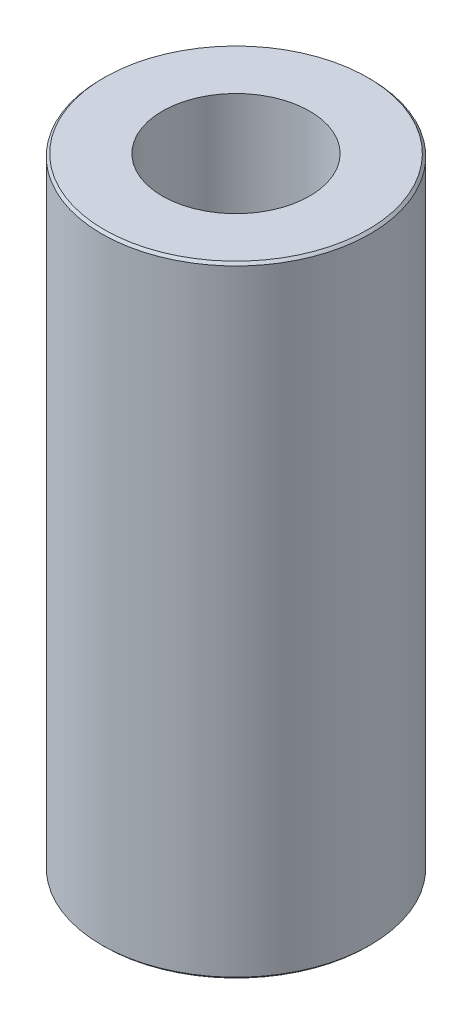
ISO-10303-21;
HEADER;
FILE_DESCRIPTION(('STEP AP214'),'2;1');
FILE_NAME('part.step','',(''),(''),'','','');
FILE_SCHEMA(('AUTOMOTIVE_DESIGN { 1 0 10303 214 1 1 1 1 }'));
ENDSEC;
DATA;
#1=APPLICATION_CONTEXT('core data for automotive mechanical design processes');
#2=APPLICATION_PROTOCOL_DEFINITION('international standard','automotive_design',2000,#1);
#3=PRODUCT_CONTEXT('',#1,'mechanical');
#4=PRODUCT('Part','Part','',(#3));
#5=PRODUCT_RELATED_PRODUCT_CATEGORY('part','',(#4));
#6=PRODUCT_DEFINITION_FORMATION('','',#4);
#7=PRODUCT_DEFINITION_CONTEXT('part definition',#1,'design');
#8=PRODUCT_DEFINITION('design','',#6,#7);
#9=PRODUCT_DEFINITION_SHAPE('','',#8);
#10=(LENGTH_UNIT() NAMED_UNIT(*) SI_UNIT(.MILLI.,.METRE.));
#11=(NAMED_UNIT(*) PLANE_ANGLE_UNIT() SI_UNIT($,.RADIAN.));
#12=(NAMED_UNIT(*) SI_UNIT($,.STERADIAN.) SOLID_ANGLE_UNIT());
#13=UNCERTAINTY_MEASURE_WITH_UNIT(LENGTH_MEASURE(1.E-05),#10,'distance_accuracy_value','');
#14=(GEOMETRIC_REPRESENTATION_CONTEXT(3) GLOBAL_UNCERTAINTY_ASSIGNED_CONTEXT((#13)) GLOBAL_UNIT_ASSIGNED_CONTEXT((#10,
#11,#12)) REPRESENTATION_CONTEXT('',''));
#15=CARTESIAN_POINT('',(0.,0.,0.));
#16=DIRECTION('',(0.,0.,1.));
#17=DIRECTION('',(1.,0.,0.));
#18=AXIS2_PLACEMENT_3D('',#15,#16,#17);
#19=CARTESIAN_POINT('',(0.,185.014265715078,0.));
#20=DIRECTION('',(0.,-1.,0.));
#21=DIRECTION('',(0.,0.,-1.));
#22=AXIS2_PLACEMENT_3D('',#19,#20,#21);
#23=CYLINDRICAL_SURFACE('',#22,40.);
#24=CARTESIAN_POINT('',(0.,184.285870189936,0.));
#25=DIRECTION('',(0.,1.,0.));
#26=DIRECTION('',(0.,0.,1.));
#27=AXIS2_PLACEMENT_3D('',#24,#25,#26);
#28=CIRCLE('',#27,40.);
#29=CARTESIAN_POINT('',(0.,184.285870189936,40.));
#30=VERTEX_POINT('',#29);
#31=EDGE_CURVE('E50',#30,#30,#28,.F.);
#32=ORIENTED_EDGE('',*,*,#31,.T.);
#33=EDGE_LOOP('',(#32));
#34=FACE_BOUND('',#33,.T.);
#35=CARTESIAN_POINT('',(0.,0.728395525141701,0.));
#36=DIRECTION('',(0.,1.,0.));
#37=DIRECTION('',(0.,0.,1.));
#38=AXIS2_PLACEMENT_3D('',#35,#36,#37);
#39=CIRCLE('',#38,40.);
#40=CARTESIAN_POINT('',(0.,0.728395525141701,40.));
#41=VERTEX_POINT('',#40);
#42=EDGE_CURVE('E51',#41,#41,#39,.T.);
#43=ORIENTED_EDGE('',*,*,#42,.T.);
#44=EDGE_LOOP('',(#43));
#45=FACE_BOUND('',#44,.T.);
#46=ADVANCED_FACE('F39',(#34,#45),#23,.T.);
#47=CARTESIAN_POINT('',(0.,185.014265715078,0.));
#48=DIRECTION('',(0.,1.,0.));
#49=DIRECTION('',(0.,0.,1.));
#50=AXIS2_PLACEMENT_3D('',#47,#48,#49);
#51=PLANE('',#50);
#52=CARTESIAN_POINT('',(0.,185.014265715078,0.));
#53=DIRECTION('',(0.,1.,0.));
#54=DIRECTION('',(0.,0.,1.));
#55=AXIS2_PLACEMENT_3D('',#52,#53,#54);
#56=CIRCLE('',#55,39.2716044748583);
#57=CARTESIAN_POINT('',(0.,185.014265715078,39.2716044748583));
#58=VERTEX_POINT('',#57);
#59=EDGE_CURVE('E54',#58,#58,#56,.T.);
#60=ORIENTED_EDGE('',*,*,#59,.T.);
#61=EDGE_LOOP('',(#60));
#62=FACE_BOUND('',#61,.T.);
#63=CARTESIAN_POINT('',(0.,185.014265715078,0.));
#64=DIRECTION('',(0.,1.,0.));
#65=DIRECTION('',(0.,0.,1.));
#66=AXIS2_PLACEMENT_3D('',#63,#64,#65);
#67=CIRCLE('',#66,21.9494563485371);
#68=CARTESIAN_POINT('',(0.,185.014265715078,21.9494563485371));
#69=VERTEX_POINT('',#68);
#70=EDGE_CURVE('E58',#69,#69,#67,.T.);
#71=ORIENTED_EDGE('',*,*,#70,.F.);
#72=EDGE_LOOP('',(#71));
#73=FACE_BOUND('',#72,.T.);
#74=ADVANCED_FACE('F69',(#62,#73),#51,.T.);
#75=CARTESIAN_POINT('',(0.,0.,0.));
#76=DIRECTION('',(0.,1.,0.));
#77=DIRECTION('',(0.,0.,1.));
#78=AXIS2_PLACEMENT_3D('',#75,#76,#77);
#79=PLANE('',#78);
#80=CARTESIAN_POINT('',(0.,0.,0.));
#81=DIRECTION('',(0.,1.,0.));
#82=DIRECTION('',(0.,0.,1.));
#83=AXIS2_PLACEMENT_3D('',#80,#81,#82);
#84=CIRCLE('',#83,39.2716044748583);
#85=CARTESIAN_POINT('',(0.,0.,39.2716044748583));
#86=VERTEX_POINT('',#85);
#87=EDGE_CURVE('E10',#86,#86,#84,.F.);
#88=ORIENTED_EDGE('',*,*,#87,.T.);
#89=EDGE_LOOP('',(#88));
#90=FACE_BOUND('',#89,.T.);
#91=CARTESIAN_POINT('',(0.,0.,0.));
#92=DIRECTION('',(0.,1.,0.));
#93=DIRECTION('',(0.,0.,1.));
#94=AXIS2_PLACEMENT_3D('',#91,#92,#93);
#95=CIRCLE('',#94,21.9494563485371);
#96=CARTESIAN_POINT('',(0.,0.,21.9494563485371));
#97=VERTEX_POINT('',#96);
#98=EDGE_CURVE('E63',#97,#97,#95,.T.);
#99=ORIENTED_EDGE('',*,*,#98,.T.);
#100=EDGE_LOOP('',(#99));
#101=FACE_BOUND('',#100,.T.);
#102=ADVANCED_FACE('F75',(#90,#101),#79,.F.);
#103=CARTESIAN_POINT('',(0.,185.014265715078,0.));
#104=DIRECTION('',(0.,-1.,0.));
#105=DIRECTION('',(0.,0.,-1.));
#106=AXIS2_PLACEMENT_3D('',#103,#104,#105);
#107=CYLINDRICAL_SURFACE('',#106,21.9494563485371);
#108=ORIENTED_EDGE('',*,*,#70,.T.);
#109=EDGE_LOOP('',(#108));
#110=FACE_BOUND('',#109,.T.);
#111=ORIENTED_EDGE('',*,*,#98,.F.);
#112=EDGE_LOOP('',(#111));
#113=FACE_BOUND('',#112,.T.);
#114=ADVANCED_FACE('F70',(#110,#113),#107,.F.);
#115=CARTESIAN_POINT('',(0.,185.014265715078,0.));
#116=DIRECTION('',(0.,-1.,0.));
#117=DIRECTION('',(0.,0.,-1.));
#118=AXIS2_PLACEMENT_3D('',#115,#116,#117);
#119=CONICAL_SURFACE('',#118,39.2716044748583,0.785398163397444);
#120=ORIENTED_EDGE('',*,*,#31,.F.);
#121=EDGE_LOOP('',(#120));
#122=FACE_BOUND('',#121,.T.);
#123=ORIENTED_EDGE('',*,*,#59,.F.);
#124=EDGE_LOOP('',(#123));
#125=FACE_BOUND('',#124,.T.);
#126=ADVANCED_FACE('F81',(#122,#125),#119,.T.);
#127=CARTESIAN_POINT('',(0.,0.728395525141701,0.));
#128=DIRECTION('',(0.,1.,0.));
#129=DIRECTION('',(0.,0.,1.));
#130=AXIS2_PLACEMENT_3D('',#127,#128,#129);
#131=CONICAL_SURFACE('',#130,40.,0.785398163397453);
#132=ORIENTED_EDGE('',*,*,#87,.F.);
#133=EDGE_LOOP('',(#132));
#134=FACE_BOUND('',#133,.T.);
#135=ORIENTED_EDGE('',*,*,#42,.F.);
#136=EDGE_LOOP('',(#135));
#137=FACE_BOUND('',#136,.T.);
#138=ADVANCED_FACE('F45',(#134,#137),#131,.T.);
#139=CLOSED_SHELL('',(#46,#74,#102,#114,#126,#138));
#140=MANIFOLD_SOLID_BREP('B2',#139);
#141=ADVANCED_BREP_SHAPE_REPRESENTATION('',(#18,#140),#14);
#142=SHAPE_DEFINITION_REPRESENTATION(#9,#141);
ENDSEC;
END-ISO-10303-21;
